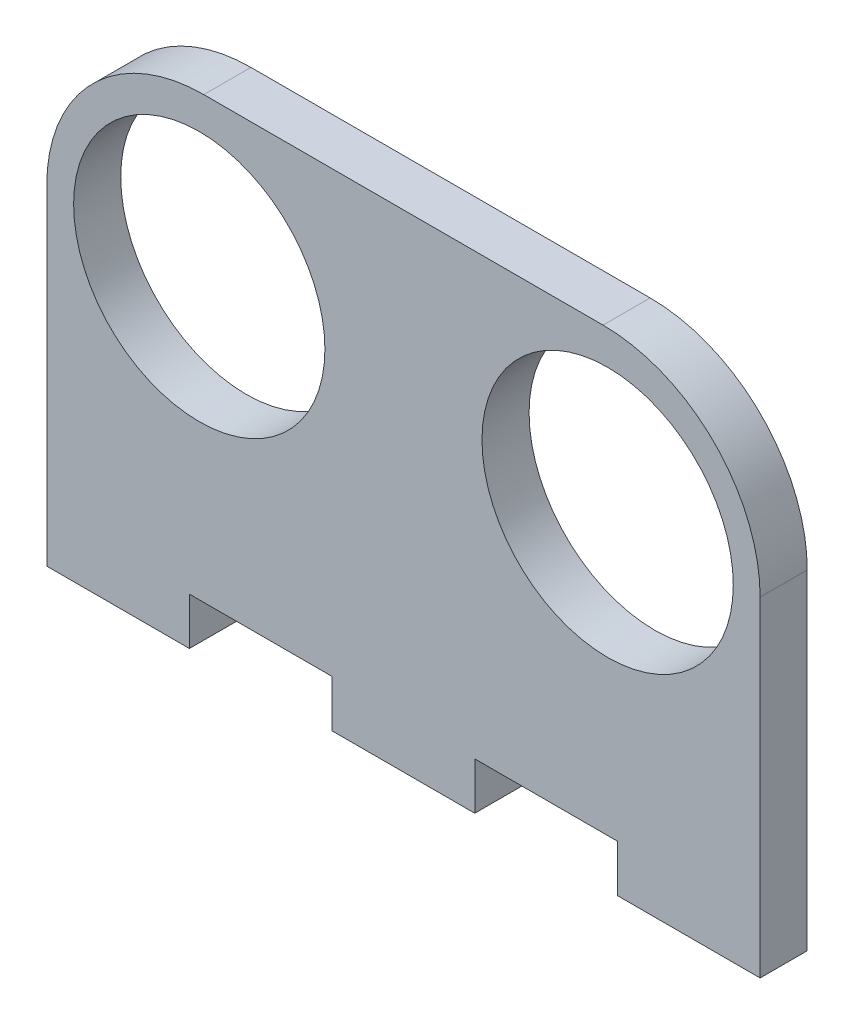
ISO-10303-21;
HEADER;
FILE_DESCRIPTION(('STEP AP214'),'2;1');
FILE_NAME('part.step','',(''),(''),'','','');
FILE_SCHEMA(('AUTOMOTIVE_DESIGN { 1 0 10303 214 1 1 1 1 }'));
ENDSEC;
DATA;
#1=APPLICATION_CONTEXT('core data for automotive mechanical design processes');
#2=APPLICATION_PROTOCOL_DEFINITION('international standard','automotive_design',2000,#1);
#3=PRODUCT_CONTEXT('',#1,'mechanical');
#4=PRODUCT('Part','Part','',(#3));
#5=PRODUCT_RELATED_PRODUCT_CATEGORY('part','',(#4));
#6=PRODUCT_DEFINITION_FORMATION('','',#4);
#7=PRODUCT_DEFINITION_CONTEXT('part definition',#1,'design');
#8=PRODUCT_DEFINITION('design','',#6,#7);
#9=PRODUCT_DEFINITION_SHAPE('','',#8);
#10=(LENGTH_UNIT() NAMED_UNIT(*) SI_UNIT(.MILLI.,.METRE.));
#11=(NAMED_UNIT(*) PLANE_ANGLE_UNIT() SI_UNIT($,.RADIAN.));
#12=(NAMED_UNIT(*) SI_UNIT($,.STERADIAN.) SOLID_ANGLE_UNIT());
#13=UNCERTAINTY_MEASURE_WITH_UNIT(LENGTH_MEASURE(1.E-05),#10,'distance_accuracy_value','');
#14=(GEOMETRIC_REPRESENTATION_CONTEXT(3) GLOBAL_UNCERTAINTY_ASSIGNED_CONTEXT((#13)) GLOBAL_UNIT_ASSIGNED_CONTEXT((#10,
#11,#12)) REPRESENTATION_CONTEXT('',''));
#15=CARTESIAN_POINT('',(0.,0.,0.));
#16=DIRECTION('',(0.,0.,1.));
#17=DIRECTION('',(1.,0.,0.));
#18=AXIS2_PLACEMENT_3D('',#15,#16,#17);
#19=CARTESIAN_POINT('',(-22.71,-10.17,3.));
#20=DIRECTION('',(0.,1.,0.));
#21=DIRECTION('',(0.,0.,1.));
#22=AXIS2_PLACEMENT_3D('',#19,#20,#21);
#23=PLANE('',#22);
#24=DIRECTION('',(0.,0.,-1.));
#25=VECTOR('',#24,1.);
#26=CARTESIAN_POINT('',(13.626,-10.17,0.));
#27=LINE('',#26,#25);
#28=CARTESIAN_POINT('',(13.626,-10.17,3.));
#29=VERTEX_POINT('',#28);
#30=CARTESIAN_POINT('',(13.626,-10.17,0.));
#31=VERTEX_POINT('',#30);
#32=EDGE_CURVE('E57',#29,#31,#27,.T.);
#33=ORIENTED_EDGE('',*,*,#32,.F.);
#34=DIRECTION('',(1.,0.,0.));
#35=VECTOR('',#34,1.);
#36=CARTESIAN_POINT('',(-22.71,-10.17,3.));
#37=LINE('',#36,#35);
#38=CARTESIAN_POINT('',(4.542,-10.17,3.));
#39=VERTEX_POINT('',#38);
#40=EDGE_CURVE('E165',#39,#29,#37,.T.);
#41=ORIENTED_EDGE('',*,*,#40,.F.);
#42=DIRECTION('',(0.,0.,-1.));
#43=VECTOR('',#42,1.);
#44=CARTESIAN_POINT('',(4.542,-10.17,0.));
#45=LINE('',#44,#43);
#46=CARTESIAN_POINT('',(4.542,-10.17,0.));
#47=VERTEX_POINT('',#46);
#48=EDGE_CURVE('E167',#39,#47,#45,.T.);
#49=ORIENTED_EDGE('',*,*,#48,.T.);
#50=DIRECTION('',(1.,0.,0.));
#51=VECTOR('',#50,1.);
#52=CARTESIAN_POINT('',(-22.71,-10.17,0.));
#53=LINE('',#52,#51);
#54=EDGE_CURVE('E62',#47,#31,#53,.T.);
#55=ORIENTED_EDGE('',*,*,#54,.T.);
#56=EDGE_LOOP('',(#33,#41,#49,#55));
#57=FACE_BOUND('',#56,.T.);
#58=ADVANCED_FACE('F41',(#57),#23,.F.);
#59=DIRECTION('',(0.,0.,-1.));
#60=VECTOR('',#59,1.);
#61=CARTESIAN_POINT('',(-4.542,-10.17,0.));
#62=LINE('',#61,#60);
#63=CARTESIAN_POINT('',(-4.542,-10.17,3.));
#64=VERTEX_POINT('',#63);
#65=CARTESIAN_POINT('',(-4.542,-10.17,0.));
#66=VERTEX_POINT('',#65);
#67=EDGE_CURVE('E171',#64,#66,#62,.T.);
#68=ORIENTED_EDGE('',*,*,#67,.F.);
#69=CARTESIAN_POINT('',(-13.626,-10.17,3.));
#70=VERTEX_POINT('',#69);
#71=EDGE_CURVE('E253',#70,#64,#37,.T.);
#72=ORIENTED_EDGE('',*,*,#71,.F.);
#73=DIRECTION('',(0.,0.,-1.));
#74=VECTOR('',#73,1.);
#75=CARTESIAN_POINT('',(-13.626,-10.17,0.));
#76=LINE('',#75,#74);
#77=CARTESIAN_POINT('',(-13.626,-10.17,0.));
#78=VERTEX_POINT('',#77);
#79=EDGE_CURVE('E207',#70,#78,#76,.T.);
#80=ORIENTED_EDGE('',*,*,#79,.T.);
#81=EDGE_CURVE('E272',#78,#66,#53,.T.);
#82=ORIENTED_EDGE('',*,*,#81,.T.);
#83=EDGE_LOOP('',(#68,#72,#80,#82));
#84=FACE_BOUND('',#83,.T.);
#85=ADVANCED_FACE('F342',(#84),#23,.F.);
#86=CARTESIAN_POINT('',(-22.71,-10.17,3.));
#87=DIRECTION('',(1.,0.,0.));
#88=DIRECTION('',(0.,1.,0.));
#89=AXIS2_PLACEMENT_3D('',#86,#87,#88);
#90=PLANE('',#89);
#91=DIRECTION('',(0.,-1.,0.));
#92=VECTOR('',#91,1.);
#93=CARTESIAN_POINT('',(-22.71,-10.17,0.));
#94=LINE('',#93,#92);
#95=CARTESIAN_POINT('',(-22.71,7.83,0.));
#96=VERTEX_POINT('',#95);
#97=CARTESIAN_POINT('',(-22.71,-13.17,0.));
#98=VERTEX_POINT('',#97);
#99=EDGE_CURVE('E237',#96,#98,#94,.T.);
#100=ORIENTED_EDGE('',*,*,#99,.T.);
#101=DIRECTION('',(0.,0.,-1.));
#102=VECTOR('',#101,1.);
#103=CARTESIAN_POINT('',(-22.71,-13.17,0.));
#104=LINE('',#103,#102);
#105=CARTESIAN_POINT('',(-22.71,-13.17,3.));
#106=VERTEX_POINT('',#105);
#107=EDGE_CURVE('E216',#106,#98,#104,.T.);
#108=ORIENTED_EDGE('',*,*,#107,.F.);
#109=DIRECTION('',(0.,-1.,0.));
#110=VECTOR('',#109,1.);
#111=CARTESIAN_POINT('',(-22.71,-10.17,3.));
#112=LINE('',#111,#110);
#113=CARTESIAN_POINT('',(-22.71,7.83,3.));
#114=VERTEX_POINT('',#113);
#115=EDGE_CURVE('E249',#114,#106,#112,.T.);
#116=ORIENTED_EDGE('',*,*,#115,.F.);
#117=DIRECTION('',(0.,0.,-1.));
#118=VECTOR('',#117,1.);
#119=CARTESIAN_POINT('',(-22.71,7.83,3.));
#120=LINE('',#119,#118);
#121=EDGE_CURVE('E269',#114,#96,#120,.T.);
#122=ORIENTED_EDGE('',*,*,#121,.T.);
#123=EDGE_LOOP('',(#100,#108,#116,#122));
#124=FACE_BOUND('',#123,.T.);
#125=ADVANCED_FACE('F43',(#124),#90,.F.);
#126=CARTESIAN_POINT('',(22.71,-10.17,3.));
#127=DIRECTION('',(-1.,0.,0.));
#128=DIRECTION('',(0.,-1.,0.));
#129=AXIS2_PLACEMENT_3D('',#126,#127,#128);
#130=PLANE('',#129);
#131=DIRECTION('',(0.,1.,0.));
#132=VECTOR('',#131,1.);
#133=CARTESIAN_POINT('',(22.71,-10.17,0.));
#134=LINE('',#133,#132);
#135=CARTESIAN_POINT('',(22.71,-13.17,0.));
#136=VERTEX_POINT('',#135);
#137=CARTESIAN_POINT('',(22.71,7.83,0.));
#138=VERTEX_POINT('',#137);
#139=EDGE_CURVE('E275',#136,#138,#134,.T.);
#140=ORIENTED_EDGE('',*,*,#139,.T.);
#141=DIRECTION('',(0.,0.,-1.));
#142=VECTOR('',#141,1.);
#143=CARTESIAN_POINT('',(22.71,7.83,3.));
#144=LINE('',#143,#142);
#145=CARTESIAN_POINT('',(22.71,7.83,3.));
#146=VERTEX_POINT('',#145);
#147=EDGE_CURVE('E11',#146,#138,#144,.T.);
#148=ORIENTED_EDGE('',*,*,#147,.F.);
#149=DIRECTION('',(0.,1.,0.));
#150=VECTOR('',#149,1.);
#151=CARTESIAN_POINT('',(22.71,-10.17,3.));
#152=LINE('',#151,#150);
#153=CARTESIAN_POINT('',(22.71,-13.17,3.));
#154=VERTEX_POINT('',#153);
#155=EDGE_CURVE('E257',#154,#146,#152,.T.);
#156=ORIENTED_EDGE('',*,*,#155,.F.);
#157=DIRECTION('',(0.,0.,1.));
#158=VECTOR('',#157,1.);
#159=CARTESIAN_POINT('',(22.71,-13.17,0.));
#160=LINE('',#159,#158);
#161=EDGE_CURVE('E159',#136,#154,#160,.T.);
#162=ORIENTED_EDGE('',*,*,#161,.F.);
#163=EDGE_LOOP('',(#140,#148,#156,#162));
#164=FACE_BOUND('',#163,.T.);
#165=ADVANCED_FACE('F347',(#164),#130,.F.);
#166=CARTESIAN_POINT('',(12.71,7.83,3.));
#167=DIRECTION('',(0.,0.,-1.));
#168=DIRECTION('',(-1.,0.,0.));
#169=AXIS2_PLACEMENT_3D('',#166,#167,#168);
#170=CYLINDRICAL_SURFACE('',#169,10.);
#171=CARTESIAN_POINT('',(12.71,7.83,0.));
#172=DIRECTION('',(0.,0.,1.));
#173=DIRECTION('',(-1.,0.,0.));
#174=AXIS2_PLACEMENT_3D('',#171,#172,#173);
#175=CIRCLE('',#174,10.);
#176=CARTESIAN_POINT('',(12.71,17.83,0.));
#177=VERTEX_POINT('',#176);
#178=EDGE_CURVE('E278',#138,#177,#175,.T.);
#179=ORIENTED_EDGE('',*,*,#178,.T.);
#180=DIRECTION('',(0.,0.,-1.));
#181=VECTOR('',#180,1.);
#182=CARTESIAN_POINT('',(12.71,17.83,3.));
#183=LINE('',#182,#181);
#184=CARTESIAN_POINT('',(12.71,17.83,3.));
#185=VERTEX_POINT('',#184);
#186=EDGE_CURVE('E50',#185,#177,#183,.T.);
#187=ORIENTED_EDGE('',*,*,#186,.F.);
#188=CARTESIAN_POINT('',(12.71,7.83,3.));
#189=DIRECTION('',(0.,0.,1.));
#190=DIRECTION('',(-1.,0.,0.));
#191=AXIS2_PLACEMENT_3D('',#188,#189,#190);
#192=CIRCLE('',#191,10.);
#193=EDGE_CURVE('E260',#146,#185,#192,.T.);
#194=ORIENTED_EDGE('',*,*,#193,.F.);
#195=ORIENTED_EDGE('',*,*,#147,.T.);
#196=EDGE_LOOP('',(#179,#187,#194,#195));
#197=FACE_BOUND('',#196,.T.);
#198=ADVANCED_FACE('F350',(#197),#170,.T.);
#199=CARTESIAN_POINT('',(-12.71,17.83,3.));
#200=DIRECTION('',(0.,-1.,0.));
#201=DIRECTION('',(0.,0.,-1.));
#202=AXIS2_PLACEMENT_3D('',#199,#200,#201);
#203=PLANE('',#202);
#204=DIRECTION('',(-1.,0.,0.));
#205=VECTOR('',#204,1.);
#206=CARTESIAN_POINT('',(-12.71,17.83,0.));
#207=LINE('',#206,#205);
#208=CARTESIAN_POINT('',(-12.71,17.83,0.));
#209=VERTEX_POINT('',#208);
#210=EDGE_CURVE('E281',#177,#209,#207,.T.);
#211=ORIENTED_EDGE('',*,*,#210,.T.);
#212=DIRECTION('',(0.,0.,-1.));
#213=VECTOR('',#212,1.);
#214=CARTESIAN_POINT('',(-12.71,17.83,3.));
#215=LINE('',#214,#213);
#216=CARTESIAN_POINT('',(-12.71,17.83,3.));
#217=VERTEX_POINT('',#216);
#218=EDGE_CURVE('E289',#217,#209,#215,.T.);
#219=ORIENTED_EDGE('',*,*,#218,.F.);
#220=DIRECTION('',(-1.,0.,0.));
#221=VECTOR('',#220,1.);
#222=CARTESIAN_POINT('',(-12.71,17.83,3.));
#223=LINE('',#222,#221);
#224=EDGE_CURVE('E263',#185,#217,#223,.T.);
#225=ORIENTED_EDGE('',*,*,#224,.F.);
#226=ORIENTED_EDGE('',*,*,#186,.T.);
#227=EDGE_LOOP('',(#211,#219,#225,#226));
#228=FACE_BOUND('',#227,.T.);
#229=ADVANCED_FACE('F298',(#228),#203,.F.);
#230=CARTESIAN_POINT('',(-12.71,7.83,3.));
#231=DIRECTION('',(0.,0.,-1.));
#232=DIRECTION('',(-1.,0.,0.));
#233=AXIS2_PLACEMENT_3D('',#230,#231,#232);
#234=CYLINDRICAL_SURFACE('',#233,10.);
#235=CARTESIAN_POINT('',(-12.71,7.83,0.));
#236=DIRECTION('',(0.,0.,1.));
#237=DIRECTION('',(-1.,0.,0.));
#238=AXIS2_PLACEMENT_3D('',#235,#236,#237);
#239=CIRCLE('',#238,10.);
#240=EDGE_CURVE('E252',#209,#96,#239,.T.);
#241=ORIENTED_EDGE('',*,*,#240,.T.);
#242=ORIENTED_EDGE('',*,*,#121,.F.);
#243=CARTESIAN_POINT('',(-12.71,7.83,3.));
#244=DIRECTION('',(0.,0.,1.));
#245=DIRECTION('',(-1.,0.,0.));
#246=AXIS2_PLACEMENT_3D('',#243,#244,#245);
#247=CIRCLE('',#246,10.);
#248=EDGE_CURVE('E266',#217,#114,#247,.T.);
#249=ORIENTED_EDGE('',*,*,#248,.F.);
#250=ORIENTED_EDGE('',*,*,#218,.T.);
#251=EDGE_LOOP('',(#241,#242,#249,#250));
#252=FACE_BOUND('',#251,.T.);
#253=ADVANCED_FACE('F310',(#252),#234,.T.);
#254=CARTESIAN_POINT('',(-12.71,7.83,3.));
#255=DIRECTION('',(0.,0.,-1.));
#256=DIRECTION('',(-1.,0.,0.));
#257=AXIS2_PLACEMENT_3D('',#254,#255,#256);
#258=PLANE('',#257);
#259=CARTESIAN_POINT('',(-13.,7.65,3.));
#260=DIRECTION('',(0.,0.,1.));
#261=DIRECTION('',(1.,0.,0.));
#262=AXIS2_PLACEMENT_3D('',#259,#260,#261);
#263=CIRCLE('',#262,8.);
#264=CARTESIAN_POINT('',(-5.,7.65,3.));
#265=VERTEX_POINT('',#264);
#266=EDGE_CURVE('E238',#265,#265,#263,.T.);
#267=ORIENTED_EDGE('',*,*,#266,.F.);
#268=EDGE_LOOP('',(#267));
#269=FACE_BOUND('',#268,.T.);
#270=CARTESIAN_POINT('',(13.,7.65,3.));
#271=DIRECTION('',(0.,0.,1.));
#272=DIRECTION('',(1.,0.,0.));
#273=AXIS2_PLACEMENT_3D('',#270,#271,#272);
#274=CIRCLE('',#273,8.);
#275=CARTESIAN_POINT('',(21.,7.65,3.));
#276=VERTEX_POINT('',#275);
#277=EDGE_CURVE('E232',#276,#276,#274,.T.);
#278=ORIENTED_EDGE('',*,*,#277,.F.);
#279=EDGE_LOOP('',(#278));
#280=FACE_BOUND('',#279,.T.);
#281=ORIENTED_EDGE('',*,*,#115,.T.);
#282=DIRECTION('',(-1.,0.,0.));
#283=VECTOR('',#282,1.);
#284=CARTESIAN_POINT('',(0.,-13.17,3.));
#285=LINE('',#284,#283);
#286=CARTESIAN_POINT('',(-13.626,-13.17,3.));
#287=VERTEX_POINT('',#286);
#288=EDGE_CURVE('E212',#287,#106,#285,.T.);
#289=ORIENTED_EDGE('',*,*,#288,.F.);
#290=DIRECTION('',(0.,1.,0.));
#291=VECTOR('',#290,1.);
#292=CARTESIAN_POINT('',(-13.626,-13.17,3.));
#293=LINE('',#292,#291);
#294=EDGE_CURVE('E229',#287,#70,#293,.T.);
#295=ORIENTED_EDGE('',*,*,#294,.T.);
#296=ORIENTED_EDGE('',*,*,#71,.T.);
#297=DIRECTION('',(0.,1.,0.));
#298=VECTOR('',#297,1.);
#299=CARTESIAN_POINT('',(-4.542,-13.17,3.));
#300=LINE('',#299,#298);
#301=CARTESIAN_POINT('',(-4.542,-13.17,3.));
#302=VERTEX_POINT('',#301);
#303=EDGE_CURVE('E200',#302,#64,#300,.T.);
#304=ORIENTED_EDGE('',*,*,#303,.F.);
#305=DIRECTION('',(-1.,0.,0.));
#306=VECTOR('',#305,1.);
#307=CARTESIAN_POINT('',(0.,-13.17,3.));
#308=LINE('',#307,#306);
#309=CARTESIAN_POINT('',(4.542,-13.17,3.));
#310=VERTEX_POINT('',#309);
#311=EDGE_CURVE('E180',#310,#302,#308,.T.);
#312=ORIENTED_EDGE('',*,*,#311,.F.);
#313=DIRECTION('',(0.,1.,0.));
#314=VECTOR('',#313,1.);
#315=CARTESIAN_POINT('',(4.542,-13.17,3.));
#316=LINE('',#315,#314);
#317=EDGE_CURVE('E204',#310,#39,#316,.T.);
#318=ORIENTED_EDGE('',*,*,#317,.T.);
#319=ORIENTED_EDGE('',*,*,#40,.T.);
#320=DIRECTION('',(0.,1.,0.));
#321=VECTOR('',#320,1.);
#322=CARTESIAN_POINT('',(13.626,-13.17,3.));
#323=LINE('',#322,#321);
#324=CARTESIAN_POINT('',(13.626,-13.17,3.));
#325=VERTEX_POINT('',#324);
#326=EDGE_CURVE('E145',#325,#29,#323,.T.);
#327=ORIENTED_EDGE('',*,*,#326,.F.);
#328=DIRECTION('',(-1.,0.,0.));
#329=VECTOR('',#328,1.);
#330=CARTESIAN_POINT('',(0.,-13.17,3.));
#331=LINE('',#330,#329);
#332=EDGE_CURVE('E153',#154,#325,#331,.T.);
#333=ORIENTED_EDGE('',*,*,#332,.F.);
#334=ORIENTED_EDGE('',*,*,#155,.T.);
#335=ORIENTED_EDGE('',*,*,#193,.T.);
#336=ORIENTED_EDGE('',*,*,#224,.T.);
#337=ORIENTED_EDGE('',*,*,#248,.T.);
#338=EDGE_LOOP('',(#281,#289,#295,#296,#304,#312,#318,#319,#327,#333,#334,#335,#336,#337));
#339=FACE_BOUND('',#338,.T.);
#340=ADVANCED_FACE('F163',(#269,#280,#339),#258,.F.);
#341=CARTESIAN_POINT('',(-12.71,7.83,0.));
#342=DIRECTION('',(0.,0.,-1.));
#343=DIRECTION('',(-1.,0.,0.));
#344=AXIS2_PLACEMENT_3D('',#341,#342,#343);
#345=PLANE('',#344);
#346=CARTESIAN_POINT('',(-13.,7.65,0.));
#347=DIRECTION('',(0.,0.,1.));
#348=DIRECTION('',(1.,0.,0.));
#349=AXIS2_PLACEMENT_3D('',#346,#347,#348);
#350=CIRCLE('',#349,8.);
#351=CARTESIAN_POINT('',(-5.,7.65,0.));
#352=VERTEX_POINT('',#351);
#353=EDGE_CURVE('E233',#352,#352,#350,.T.);
#354=ORIENTED_EDGE('',*,*,#353,.T.);
#355=EDGE_LOOP('',(#354));
#356=FACE_BOUND('',#355,.T.);
#357=CARTESIAN_POINT('',(13.,7.65,0.));
#358=DIRECTION('',(0.,0.,1.));
#359=DIRECTION('',(1.,0.,0.));
#360=AXIS2_PLACEMENT_3D('',#357,#358,#359);
#361=CIRCLE('',#360,8.);
#362=CARTESIAN_POINT('',(21.,7.65,0.));
#363=VERTEX_POINT('',#362);
#364=EDGE_CURVE('E242',#363,#363,#361,.T.);
#365=ORIENTED_EDGE('',*,*,#364,.T.);
#366=EDGE_LOOP('',(#365));
#367=FACE_BOUND('',#366,.T.);
#368=ORIENTED_EDGE('',*,*,#99,.F.);
#369=ORIENTED_EDGE('',*,*,#240,.F.);
#370=ORIENTED_EDGE('',*,*,#210,.F.);
#371=ORIENTED_EDGE('',*,*,#178,.F.);
#372=ORIENTED_EDGE('',*,*,#139,.F.);
#373=DIRECTION('',(1.,0.,0.));
#374=VECTOR('',#373,1.);
#375=CARTESIAN_POINT('',(0.,-13.17,0.));
#376=LINE('',#375,#374);
#377=CARTESIAN_POINT('',(13.626,-13.17,0.));
#378=VERTEX_POINT('',#377);
#379=EDGE_CURVE('E152',#378,#136,#376,.T.);
#380=ORIENTED_EDGE('',*,*,#379,.F.);
#381=DIRECTION('',(0.,1.,0.));
#382=VECTOR('',#381,1.);
#383=CARTESIAN_POINT('',(13.626,-13.17,0.));
#384=LINE('',#383,#382);
#385=EDGE_CURVE('E147',#378,#31,#384,.T.);
#386=ORIENTED_EDGE('',*,*,#385,.T.);
#387=ORIENTED_EDGE('',*,*,#54,.F.);
#388=DIRECTION('',(0.,1.,0.));
#389=VECTOR('',#388,1.);
#390=CARTESIAN_POINT('',(4.542,-13.17,0.));
#391=LINE('',#390,#389);
#392=CARTESIAN_POINT('',(4.542,-13.17,0.));
#393=VERTEX_POINT('',#392);
#394=EDGE_CURVE('E188',#393,#47,#391,.T.);
#395=ORIENTED_EDGE('',*,*,#394,.F.);
#396=DIRECTION('',(1.,0.,0.));
#397=VECTOR('',#396,1.);
#398=CARTESIAN_POINT('',(0.,-13.17,0.));
#399=LINE('',#398,#397);
#400=CARTESIAN_POINT('',(-4.542,-13.17,0.));
#401=VERTEX_POINT('',#400);
#402=EDGE_CURVE('E186',#401,#393,#399,.T.);
#403=ORIENTED_EDGE('',*,*,#402,.F.);
#404=DIRECTION('',(0.,1.,0.));
#405=VECTOR('',#404,1.);
#406=CARTESIAN_POINT('',(-4.542,-13.17,0.));
#407=LINE('',#406,#405);
#408=EDGE_CURVE('E196',#401,#66,#407,.T.);
#409=ORIENTED_EDGE('',*,*,#408,.T.);
#410=ORIENTED_EDGE('',*,*,#81,.F.);
#411=DIRECTION('',(0.,1.,0.));
#412=VECTOR('',#411,1.);
#413=CARTESIAN_POINT('',(-13.626,-13.17,0.));
#414=LINE('',#413,#412);
#415=CARTESIAN_POINT('',(-13.626,-13.17,0.));
#416=VERTEX_POINT('',#415);
#417=EDGE_CURVE('E223',#416,#78,#414,.T.);
#418=ORIENTED_EDGE('',*,*,#417,.F.);
#419=DIRECTION('',(1.,0.,0.));
#420=VECTOR('',#419,1.);
#421=CARTESIAN_POINT('',(0.,-13.17,0.));
#422=LINE('',#421,#420);
#423=EDGE_CURVE('E220',#98,#416,#422,.T.);
#424=ORIENTED_EDGE('',*,*,#423,.F.);
#425=EDGE_LOOP('',(#368,#369,#370,#371,#372,#380,#386,#387,#395,#403,#409,#410,#418,#424));
#426=FACE_BOUND('',#425,.T.);
#427=ADVANCED_FACE('F306',(#356,#367,#426),#345,.T.);
#428=CARTESIAN_POINT('',(13.,7.65,0.));
#429=DIRECTION('',(0.,0.,1.));
#430=DIRECTION('',(1.,0.,0.));
#431=AXIS2_PLACEMENT_3D('',#428,#429,#430);
#432=CYLINDRICAL_SURFACE('',#431,8.);
#433=ORIENTED_EDGE('',*,*,#364,.F.);
#434=EDGE_LOOP('',(#433));
#435=FACE_BOUND('',#434,.T.);
#436=ORIENTED_EDGE('',*,*,#277,.T.);
#437=EDGE_LOOP('',(#436));
#438=FACE_BOUND('',#437,.T.);
#439=ADVANCED_FACE('F360',(#435,#438),#432,.F.);
#440=CARTESIAN_POINT('',(-13.,7.65,0.));
#441=DIRECTION('',(0.,0.,1.));
#442=DIRECTION('',(1.,0.,0.));
#443=AXIS2_PLACEMENT_3D('',#440,#441,#442);
#444=CYLINDRICAL_SURFACE('',#443,8.);
#445=ORIENTED_EDGE('',*,*,#353,.F.);
#446=EDGE_LOOP('',(#445));
#447=FACE_BOUND('',#446,.T.);
#448=ORIENTED_EDGE('',*,*,#266,.T.);
#449=EDGE_LOOP('',(#448));
#450=FACE_BOUND('',#449,.T.);
#451=ADVANCED_FACE('F367',(#447,#450),#444,.F.);
#452=CARTESIAN_POINT('',(-13.626,-13.17,0.));
#453=DIRECTION('',(1.,0.,0.));
#454=DIRECTION('',(0.,0.,-1.));
#455=AXIS2_PLACEMENT_3D('',#452,#453,#454);
#456=PLANE('',#455);
#457=ORIENTED_EDGE('',*,*,#79,.F.);
#458=ORIENTED_EDGE('',*,*,#294,.F.);
#459=DIRECTION('',(0.,0.,-1.));
#460=VECTOR('',#459,1.);
#461=CARTESIAN_POINT('',(-13.626,-13.17,0.));
#462=LINE('',#461,#460);
#463=EDGE_CURVE('E208',#287,#416,#462,.T.);
#464=ORIENTED_EDGE('',*,*,#463,.T.);
#465=ORIENTED_EDGE('',*,*,#417,.T.);
#466=EDGE_LOOP('',(#457,#458,#464,#465));
#467=FACE_BOUND('',#466,.T.);
#468=ADVANCED_FACE('F322',(#467),#456,.T.);
#469=CARTESIAN_POINT('',(0.,-13.17,0.));
#470=DIRECTION('',(0.,-1.,0.));
#471=DIRECTION('',(0.,0.,-1.));
#472=AXIS2_PLACEMENT_3D('',#469,#470,#471);
#473=PLANE('',#472);
#474=ORIENTED_EDGE('',*,*,#463,.F.);
#475=ORIENTED_EDGE('',*,*,#288,.T.);
#476=ORIENTED_EDGE('',*,*,#107,.T.);
#477=ORIENTED_EDGE('',*,*,#423,.T.);
#478=EDGE_LOOP('',(#474,#475,#476,#477));
#479=FACE_BOUND('',#478,.T.);
#480=ADVANCED_FACE('F318',(#479),#473,.T.);
#481=CARTESIAN_POINT('',(4.542,-13.17,0.));
#482=DIRECTION('',(1.,0.,0.));
#483=DIRECTION('',(0.,0.,-1.));
#484=AXIS2_PLACEMENT_3D('',#481,#482,#483);
#485=PLANE('',#484);
#486=ORIENTED_EDGE('',*,*,#48,.F.);
#487=ORIENTED_EDGE('',*,*,#317,.F.);
#488=DIRECTION('',(0.,0.,-1.));
#489=VECTOR('',#488,1.);
#490=CARTESIAN_POINT('',(4.542,-13.17,0.));
#491=LINE('',#490,#489);
#492=EDGE_CURVE('E176',#310,#393,#491,.T.);
#493=ORIENTED_EDGE('',*,*,#492,.T.);
#494=ORIENTED_EDGE('',*,*,#394,.T.);
#495=EDGE_LOOP('',(#486,#487,#493,#494));
#496=FACE_BOUND('',#495,.T.);
#497=ADVANCED_FACE('F338',(#496),#485,.T.);
#498=CARTESIAN_POINT('',(-4.542,-13.17,0.));
#499=DIRECTION('',(1.,0.,0.));
#500=DIRECTION('',(0.,0.,-1.));
#501=AXIS2_PLACEMENT_3D('',#498,#499,#500);
#502=PLANE('',#501);
#503=ORIENTED_EDGE('',*,*,#67,.T.);
#504=ORIENTED_EDGE('',*,*,#408,.F.);
#505=DIRECTION('',(0.,0.,-1.));
#506=VECTOR('',#505,1.);
#507=CARTESIAN_POINT('',(-4.542,-13.17,0.));
#508=LINE('',#507,#506);
#509=EDGE_CURVE('E183',#302,#401,#508,.T.);
#510=ORIENTED_EDGE('',*,*,#509,.F.);
#511=ORIENTED_EDGE('',*,*,#303,.T.);
#512=EDGE_LOOP('',(#503,#504,#510,#511));
#513=FACE_BOUND('',#512,.T.);
#514=ADVANCED_FACE('F329',(#513),#502,.F.);
#515=CARTESIAN_POINT('',(0.,-13.17,0.));
#516=DIRECTION('',(0.,-1.,0.));
#517=DIRECTION('',(0.,0.,-1.));
#518=AXIS2_PLACEMENT_3D('',#515,#516,#517);
#519=PLANE('',#518);
#520=ORIENTED_EDGE('',*,*,#492,.F.);
#521=ORIENTED_EDGE('',*,*,#311,.T.);
#522=ORIENTED_EDGE('',*,*,#509,.T.);
#523=ORIENTED_EDGE('',*,*,#402,.T.);
#524=EDGE_LOOP('',(#520,#521,#522,#523));
#525=FACE_BOUND('',#524,.T.);
#526=ADVANCED_FACE('F334',(#525),#519,.T.);
#527=CARTESIAN_POINT('',(13.626,-13.17,0.));
#528=DIRECTION('',(1.,0.,0.));
#529=DIRECTION('',(0.,0.,-1.));
#530=AXIS2_PLACEMENT_3D('',#527,#528,#529);
#531=PLANE('',#530);
#532=ORIENTED_EDGE('',*,*,#32,.T.);
#533=ORIENTED_EDGE('',*,*,#385,.F.);
#534=DIRECTION('',(0.,0.,-1.));
#535=VECTOR('',#534,1.);
#536=CARTESIAN_POINT('',(13.626,-13.17,0.));
#537=LINE('',#536,#535);
#538=EDGE_CURVE('E141',#325,#378,#537,.T.);
#539=ORIENTED_EDGE('',*,*,#538,.F.);
#540=ORIENTED_EDGE('',*,*,#326,.T.);
#541=EDGE_LOOP('',(#532,#533,#539,#540));
#542=FACE_BOUND('',#541,.T.);
#543=ADVANCED_FACE('F143',(#542),#531,.F.);
#544=CARTESIAN_POINT('',(0.,-13.17,0.));
#545=DIRECTION('',(0.,-1.,0.));
#546=DIRECTION('',(0.,0.,-1.));
#547=AXIS2_PLACEMENT_3D('',#544,#545,#546);
#548=PLANE('',#547);
#549=ORIENTED_EDGE('',*,*,#332,.T.);
#550=ORIENTED_EDGE('',*,*,#538,.T.);
#551=ORIENTED_EDGE('',*,*,#379,.T.);
#552=ORIENTED_EDGE('',*,*,#161,.T.);
#553=EDGE_LOOP('',(#549,#550,#551,#552));
#554=FACE_BOUND('',#553,.T.);
#555=ADVANCED_FACE('F157',(#554),#548,.T.);
#556=CLOSED_SHELL('',(#58,#85,#125,#165,#198,#229,#253,#340,#427,#439,#451,#468,#480,#497,#514,
#526,#543,#555));
#557=MANIFOLD_SOLID_BREP('B2',#556);
#558=ADVANCED_BREP_SHAPE_REPRESENTATION('',(#18,#557),#14);
#559=SHAPE_DEFINITION_REPRESENTATION(#9,#558);
ENDSEC;
END-ISO-10303-21;
